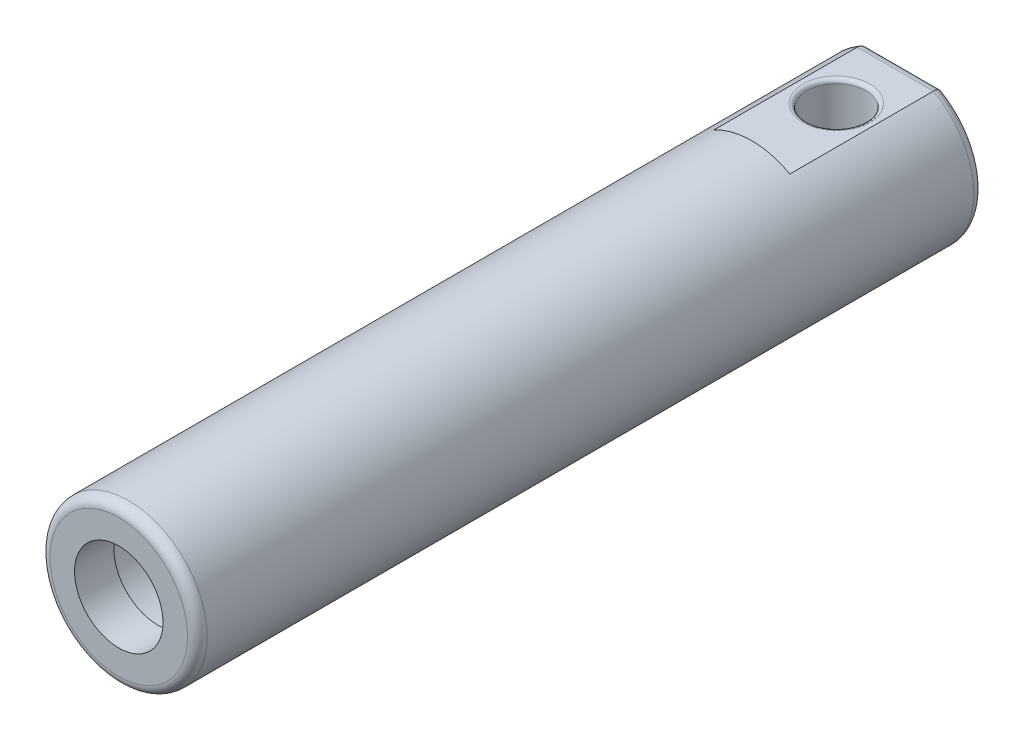
ISO-10303-21;
HEADER;
FILE_DESCRIPTION(('STEP AP214'),'2;1');
FILE_NAME('part.step','',(''),(''),'','','');
FILE_SCHEMA(('AUTOMOTIVE_DESIGN { 1 0 10303 214 1 1 1 1 }'));
ENDSEC;
DATA;
#1=APPLICATION_CONTEXT('core data for automotive mechanical design processes');
#2=APPLICATION_PROTOCOL_DEFINITION('international standard','automotive_design',2000,#1);
#3=PRODUCT_CONTEXT('',#1,'mechanical');
#4=PRODUCT('Part','Part','',(#3));
#5=PRODUCT_RELATED_PRODUCT_CATEGORY('part','',(#4));
#6=PRODUCT_DEFINITION_FORMATION('','',#4);
#7=PRODUCT_DEFINITION_CONTEXT('part definition',#1,'design');
#8=PRODUCT_DEFINITION('design','',#6,#7);
#9=PRODUCT_DEFINITION_SHAPE('','',#8);
#10=(LENGTH_UNIT() NAMED_UNIT(*) SI_UNIT(.MILLI.,.METRE.));
#11=(NAMED_UNIT(*) PLANE_ANGLE_UNIT() SI_UNIT($,.RADIAN.));
#12=(NAMED_UNIT(*) SI_UNIT($,.STERADIAN.) SOLID_ANGLE_UNIT());
#13=UNCERTAINTY_MEASURE_WITH_UNIT(LENGTH_MEASURE(1.E-05),#10,'distance_accuracy_value','');
#14=(GEOMETRIC_REPRESENTATION_CONTEXT(3) GLOBAL_UNCERTAINTY_ASSIGNED_CONTEXT((#13)) GLOBAL_UNIT_ASSIGNED_CONTEXT((#10,
#11,#12)) REPRESENTATION_CONTEXT('',''));
#15=CARTESIAN_POINT('',(0.,0.,0.));
#16=DIRECTION('',(0.,0.,1.));
#17=DIRECTION('',(1.,0.,0.));
#18=AXIS2_PLACEMENT_3D('',#15,#16,#17);
#19=CARTESIAN_POINT('',(0.,0.,320.));
#20=DIRECTION('',(0.,0.,-1.));
#21=DIRECTION('',(-1.,0.,0.));
#22=AXIS2_PLACEMENT_3D('',#19,#20,#21);
#23=CYLINDRICAL_SURFACE('',#22,40.);
#24=CARTESIAN_POINT('',(0.,0.,315.));
#25=DIRECTION('',(0.,0.,1.));
#26=DIRECTION('',(1.,0.,0.));
#27=AXIS2_PLACEMENT_3D('',#24,#25,#26);
#28=CIRCLE('',#27,40.);
#29=CARTESIAN_POINT('',(40.,0.,315.));
#30=VERTEX_POINT('',#29);
#31=EDGE_CURVE('E182',#30,#30,#28,.F.);
#32=ORIENTED_EDGE('',*,*,#31,.T.);
#33=EDGE_LOOP('',(#32));
#34=FACE_BOUND('',#33,.T.);
#35=DIRECTION('',(0.,0.,-1.));
#36=VECTOR('',#35,1.);
#37=CARTESIAN_POINT('',(19.3649167310371,-35.,320.));
#38=LINE('',#37,#36);
#39=CARTESIAN_POINT('',(19.3649167310371,-35.,-2.));
#40=VERTEX_POINT('',#39);
#41=CARTESIAN_POINT('',(19.3649167310371,-35.,-75.));
#42=VERTEX_POINT('',#41);
#43=EDGE_CURVE('E115',#40,#42,#38,.T.);
#44=ORIENTED_EDGE('',*,*,#43,.T.);
#45=CARTESIAN_POINT('',(0.,0.,-75.));
#46=DIRECTION('',(0.,0.,-1.));
#47=DIRECTION('',(-1.,0.,0.));
#48=AXIS2_PLACEMENT_3D('',#45,#46,#47);
#49=CIRCLE('',#48,40.);
#50=CARTESIAN_POINT('',(19.3649167310371,35.,-75.));
#51=VERTEX_POINT('',#50);
#52=EDGE_CURVE('E75',#42,#51,#49,.F.);
#53=ORIENTED_EDGE('',*,*,#52,.T.);
#54=DIRECTION('',(0.,0.,-1.));
#55=VECTOR('',#54,1.);
#56=CARTESIAN_POINT('',(19.3649167310371,35.,320.));
#57=LINE('',#56,#55);
#58=CARTESIAN_POINT('',(19.3649167310371,35.,-2.));
#59=VERTEX_POINT('',#58);
#60=EDGE_CURVE('E140',#51,#59,#57,.F.);
#61=ORIENTED_EDGE('',*,*,#60,.T.);
#62=CARTESIAN_POINT('',(0.,0.,-2.));
#63=DIRECTION('',(0.,0.,1.));
#64=DIRECTION('',(1.,0.,0.));
#65=AXIS2_PLACEMENT_3D('',#62,#63,#64);
#66=CIRCLE('',#65,40.);
#67=CARTESIAN_POINT('',(-19.3649167310371,35.,-2.));
#68=VERTEX_POINT('',#67);
#69=EDGE_CURVE('E123',#59,#68,#66,.T.);
#70=ORIENTED_EDGE('',*,*,#69,.T.);
#71=DIRECTION('',(0.,0.,-1.));
#72=VECTOR('',#71,1.);
#73=CARTESIAN_POINT('',(-19.3649167310371,35.,320.));
#74=LINE('',#73,#72);
#75=CARTESIAN_POINT('',(-19.3649167310371,35.,-75.));
#76=VERTEX_POINT('',#75);
#77=EDGE_CURVE('E143',#68,#76,#74,.T.);
#78=ORIENTED_EDGE('',*,*,#77,.T.);
#79=CARTESIAN_POINT('',(0.,0.,-75.));
#80=DIRECTION('',(0.,0.,-1.));
#81=DIRECTION('',(-1.,0.,0.));
#82=AXIS2_PLACEMENT_3D('',#79,#80,#81);
#83=CIRCLE('',#82,40.);
#84=CARTESIAN_POINT('',(-19.3649167310371,-35.,-75.));
#85=VERTEX_POINT('',#84);
#86=EDGE_CURVE('E109',#76,#85,#83,.F.);
#87=ORIENTED_EDGE('',*,*,#86,.T.);
#88=DIRECTION('',(0.,0.,-1.));
#89=VECTOR('',#88,1.);
#90=CARTESIAN_POINT('',(-19.3649167310371,-35.,320.));
#91=LINE('',#90,#89);
#92=CARTESIAN_POINT('',(-19.3649167310371,-35.,-2.));
#93=VERTEX_POINT('',#92);
#94=EDGE_CURVE('E104',#85,#93,#91,.F.);
#95=ORIENTED_EDGE('',*,*,#94,.T.);
#96=CARTESIAN_POINT('',(0.,0.,-2.));
#97=DIRECTION('',(0.,0.,-1.));
#98=DIRECTION('',(-1.,0.,0.));
#99=AXIS2_PLACEMENT_3D('',#96,#97,#98);
#100=CIRCLE('',#99,40.);
#101=EDGE_CURVE('E106',#40,#93,#100,.T.);
#102=ORIENTED_EDGE('',*,*,#101,.F.);
#103=EDGE_LOOP('',(#44,#53,#61,#70,#78,#87,#95,#102));
#104=FACE_BOUND('',#103,.T.);
#105=ADVANCED_FACE('F51',(#34,#104),#23,.T.);
#106=CARTESIAN_POINT('',(0.,0.,320.));
#107=DIRECTION('',(0.,0.,1.));
#108=DIRECTION('',(1.,0.,0.));
#109=AXIS2_PLACEMENT_3D('',#106,#107,#108);
#110=PLANE('',#109);
#111=CARTESIAN_POINT('',(0.,0.,320.));
#112=DIRECTION('',(0.,0.,1.));
#113=DIRECTION('',(1.,0.,0.));
#114=AXIS2_PLACEMENT_3D('',#111,#112,#113);
#115=CIRCLE('',#114,35.);
#116=CARTESIAN_POINT('',(35.,0.,320.));
#117=VERTEX_POINT('',#116);
#118=EDGE_CURVE('E190',#117,#117,#115,.T.);
#119=ORIENTED_EDGE('',*,*,#118,.T.);
#120=EDGE_LOOP('',(#119));
#121=FACE_BOUND('',#120,.T.);
#122=CARTESIAN_POINT('',(0.,0.,320.));
#123=DIRECTION('',(0.,0.,1.));
#124=DIRECTION('',(1.,0.,0.));
#125=AXIS2_PLACEMENT_3D('',#122,#123,#124);
#126=CIRCLE('',#125,22.5);
#127=CARTESIAN_POINT('',(22.5,0.,320.));
#128=VERTEX_POINT('',#127);
#129=EDGE_CURVE('E147',#128,#128,#126,.T.);
#130=ORIENTED_EDGE('',*,*,#129,.F.);
#131=EDGE_LOOP('',(#130));
#132=FACE_BOUND('',#131,.T.);
#133=ADVANCED_FACE('F267',(#121,#132),#110,.T.);
#134=CARTESIAN_POINT('',(0.,0.,300.));
#135=DIRECTION('',(0.,0.,-1.));
#136=DIRECTION('',(-1.,0.,0.));
#137=AXIS2_PLACEMENT_3D('',#134,#135,#136);
#138=CYLINDRICAL_SURFACE('',#137,30.);
#139=CARTESIAN_POINT('',(0.,0.,300.));
#140=DIRECTION('',(0.,0.,-1.));
#141=DIRECTION('',(-1.,0.,0.));
#142=AXIS2_PLACEMENT_3D('',#139,#140,#141);
#143=CIRCLE('',#142,30.);
#144=CARTESIAN_POINT('',(-30.,0.,300.));
#145=VERTEX_POINT('',#144);
#146=EDGE_CURVE('E151',#145,#145,#143,.T.);
#147=ORIENTED_EDGE('',*,*,#146,.F.);
#148=EDGE_LOOP('',(#147));
#149=FACE_BOUND('',#148,.T.);
#150=CARTESIAN_POINT('',(0.,0.,0.));
#151=DIRECTION('',(0.,0.,-1.));
#152=DIRECTION('',(-1.,0.,0.));
#153=AXIS2_PLACEMENT_3D('',#150,#151,#152);
#154=CIRCLE('',#153,30.);
#155=CARTESIAN_POINT('',(-30.,0.,0.));
#156=VERTEX_POINT('',#155);
#157=EDGE_CURVE('E146',#156,#156,#154,.T.);
#158=ORIENTED_EDGE('',*,*,#157,.T.);
#159=EDGE_LOOP('',(#158));
#160=FACE_BOUND('',#159,.T.);
#161=ADVANCED_FACE('F272',(#149,#160),#138,.F.);
#162=CARTESIAN_POINT('',(0.,0.,300.));
#163=DIRECTION('',(0.,0.,-1.));
#164=DIRECTION('',(-1.,0.,0.));
#165=AXIS2_PLACEMENT_3D('',#162,#163,#164);
#166=PLANE('',#165);
#167=CARTESIAN_POINT('',(0.,0.,300.));
#168=DIRECTION('',(0.,0.,-1.));
#169=DIRECTION('',(-1.,0.,0.));
#170=AXIS2_PLACEMENT_3D('',#167,#168,#169);
#171=CIRCLE('',#170,22.5);
#172=CARTESIAN_POINT('',(-22.5,0.,300.));
#173=VERTEX_POINT('',#172);
#174=EDGE_CURVE('E152',#173,#173,#171,.F.);
#175=ORIENTED_EDGE('',*,*,#174,.T.);
#176=EDGE_LOOP('',(#175));
#177=FACE_BOUND('',#176,.T.);
#178=ORIENTED_EDGE('',*,*,#146,.T.);
#179=EDGE_LOOP('',(#178));
#180=FACE_BOUND('',#179,.T.);
#181=ADVANCED_FACE('F278',(#177,#180),#166,.T.);
#182=CARTESIAN_POINT('',(0.,0.,-0.000999999999973245));
#183=DIRECTION('',(0.,0.,1.));
#184=DIRECTION('',(1.,0.,0.));
#185=AXIS2_PLACEMENT_3D('',#182,#183,#184);
#186=CYLINDRICAL_SURFACE('',#185,22.5);
#187=ORIENTED_EDGE('',*,*,#174,.F.);
#188=EDGE_LOOP('',(#187));
#189=FACE_BOUND('',#188,.T.);
#190=ORIENTED_EDGE('',*,*,#129,.T.);
#191=EDGE_LOOP('',(#190));
#192=FACE_BOUND('',#191,.T.);
#193=ADVANCED_FACE('F282',(#189,#192),#186,.F.);
#194=CARTESIAN_POINT('',(0.,0.,0.));
#195=DIRECTION('',(0.,0.,-1.));
#196=DIRECTION('',(-1.,0.,0.));
#197=AXIS2_PLACEMENT_3D('',#194,#195,#196);
#198=PLANE('',#197);
#199=ORIENTED_EDGE('',*,*,#157,.F.);
#200=EDGE_LOOP('',(#199));
#201=FACE_BOUND('',#200,.T.);
#202=ADVANCED_FACE('F286',(#201),#198,.F.);
#203=CARTESIAN_POINT('',(0.,0.,-80.));
#204=DIRECTION('',(0.,0.,-1.));
#205=DIRECTION('',(-1.,0.,0.));
#206=AXIS2_PLACEMENT_3D('',#203,#204,#205);
#207=PLANE('',#206);
#208=DIRECTION('',(-1.,0.,0.));
#209=VECTOR('',#208,1.);
#210=CARTESIAN_POINT('',(19.3649167310371,30.,-80.));
#211=LINE('',#210,#209);
#212=CARTESIAN_POINT('',(-18.0277563773199,30.,-80.));
#213=VERTEX_POINT('',#212);
#214=CARTESIAN_POINT('',(18.0277563773199,30.,-80.));
#215=VERTEX_POINT('',#214);
#216=EDGE_CURVE('E170',#213,#215,#211,.F.);
#217=ORIENTED_EDGE('',*,*,#216,.T.);
#218=CARTESIAN_POINT('',(0.,0.,-80.));
#219=DIRECTION('',(0.,0.,-1.));
#220=DIRECTION('',(-1.,0.,0.));
#221=AXIS2_PLACEMENT_3D('',#218,#219,#220);
#222=CIRCLE('',#221,35.);
#223=CARTESIAN_POINT('',(18.0277563773199,-30.,-80.));
#224=VERTEX_POINT('',#223);
#225=EDGE_CURVE('E177',#215,#224,#222,.T.);
#226=ORIENTED_EDGE('',*,*,#225,.T.);
#227=DIRECTION('',(1.,0.,0.));
#228=VECTOR('',#227,1.);
#229=CARTESIAN_POINT('',(-19.3649167310371,-30.,-80.));
#230=LINE('',#229,#228);
#231=CARTESIAN_POINT('',(-18.0277563773199,-30.,-80.));
#232=VERTEX_POINT('',#231);
#233=EDGE_CURVE('E173',#224,#232,#230,.F.);
#234=ORIENTED_EDGE('',*,*,#233,.T.);
#235=CARTESIAN_POINT('',(0.,0.,-80.));
#236=DIRECTION('',(0.,0.,-1.));
#237=DIRECTION('',(-1.,0.,0.));
#238=AXIS2_PLACEMENT_3D('',#235,#236,#237);
#239=CIRCLE('',#238,35.);
#240=EDGE_CURVE('E167',#232,#213,#239,.T.);
#241=ORIENTED_EDGE('',*,*,#240,.T.);
#242=EDGE_LOOP('',(#217,#226,#234,#241));
#243=FACE_BOUND('',#242,.T.);
#244=ADVANCED_FACE('F290',(#243),#207,.T.);
#245=CARTESIAN_POINT('',(20.,35.,-2.));
#246=DIRECTION('',(0.,0.,1.));
#247=DIRECTION('',(1.,0.,0.));
#248=AXIS2_PLACEMENT_3D('',#245,#246,#247);
#249=PLANE('',#248);
#250=DIRECTION('',(1.,0.,0.));
#251=VECTOR('',#250,1.);
#252=CARTESIAN_POINT('',(20.,35.,-2.));
#253=LINE('',#252,#251);
#254=EDGE_CURVE('E136',#68,#59,#253,.T.);
#255=ORIENTED_EDGE('',*,*,#254,.F.);
#256=ORIENTED_EDGE('',*,*,#69,.F.);
#257=EDGE_LOOP('',(#255,#256));
#258=FACE_BOUND('',#257,.T.);
#259=ADVANCED_FACE('F294',(#258),#249,.F.);
#260=CARTESIAN_POINT('',(0.,35.,0.));
#261=DIRECTION('',(0.,-1.,0.));
#262=DIRECTION('',(0.,0.,-1.));
#263=AXIS2_PLACEMENT_3D('',#260,#261,#262);
#264=PLANE('',#263);
#265=CARTESIAN_POINT('',(0.,35.,-45.));
#266=DIRECTION('',(0.,-1.,0.));
#267=DIRECTION('',(0.,0.,-1.));
#268=AXIS2_PLACEMENT_3D('',#265,#266,#267);
#269=CIRCLE('',#268,17.);
#270=CARTESIAN_POINT('',(0.,35.,-62.));
#271=VERTEX_POINT('',#270);
#272=EDGE_CURVE('E11',#271,#271,#269,.T.);
#273=ORIENTED_EDGE('',*,*,#272,.T.);
#274=EDGE_LOOP('',(#273));
#275=FACE_BOUND('',#274,.T.);
#276=ORIENTED_EDGE('',*,*,#60,.F.);
#277=DIRECTION('',(-1.,0.,0.));
#278=VECTOR('',#277,1.);
#279=CARTESIAN_POINT('',(-19.3649167310371,35.,-75.));
#280=LINE('',#279,#278);
#281=EDGE_CURVE('E67',#51,#76,#280,.T.);
#282=ORIENTED_EDGE('',*,*,#281,.T.);
#283=ORIENTED_EDGE('',*,*,#77,.F.);
#284=ORIENTED_EDGE('',*,*,#254,.T.);
#285=EDGE_LOOP('',(#276,#282,#283,#284));
#286=FACE_BOUND('',#285,.T.);
#287=ADVANCED_FACE('F264',(#275,#286),#264,.F.);
#288=CARTESIAN_POINT('',(20.,-35.,-2.));
#289=DIRECTION('',(0.,0.,-1.));
#290=DIRECTION('',(-1.,0.,0.));
#291=AXIS2_PLACEMENT_3D('',#288,#289,#290);
#292=PLANE('',#291);
#293=DIRECTION('',(1.,0.,0.));
#294=VECTOR('',#293,1.);
#295=CARTESIAN_POINT('',(20.,-35.,-2.));
#296=LINE('',#295,#294);
#297=EDGE_CURVE('E116',#93,#40,#296,.T.);
#298=ORIENTED_EDGE('',*,*,#297,.T.);
#299=ORIENTED_EDGE('',*,*,#101,.T.);
#300=EDGE_LOOP('',(#298,#299));
#301=FACE_BOUND('',#300,.T.);
#302=ADVANCED_FACE('F120',(#301),#292,.T.);
#303=CARTESIAN_POINT('',(0.,-35.,0.));
#304=DIRECTION('',(0.,1.,0.));
#305=DIRECTION('',(0.,0.,-1.));
#306=AXIS2_PLACEMENT_3D('',#303,#304,#305);
#307=PLANE('',#306);
#308=CARTESIAN_POINT('',(0.,-35.,-45.));
#309=DIRECTION('',(0.,1.,0.));
#310=DIRECTION('',(0.,0.,1.));
#311=AXIS2_PLACEMENT_3D('',#308,#309,#310);
#312=CIRCLE('',#311,17.);
#313=CARTESIAN_POINT('',(0.,-35.,-28.));
#314=VERTEX_POINT('',#313);
#315=EDGE_CURVE('E194',#314,#314,#312,.T.);
#316=ORIENTED_EDGE('',*,*,#315,.T.);
#317=EDGE_LOOP('',(#316));
#318=FACE_BOUND('',#317,.T.);
#319=ORIENTED_EDGE('',*,*,#94,.F.);
#320=DIRECTION('',(1.,0.,0.));
#321=VECTOR('',#320,1.);
#322=CARTESIAN_POINT('',(19.3649167310371,-35.,-75.));
#323=LINE('',#322,#321);
#324=EDGE_CURVE('E122',#85,#42,#323,.T.);
#325=ORIENTED_EDGE('',*,*,#324,.T.);
#326=ORIENTED_EDGE('',*,*,#43,.F.);
#327=ORIENTED_EDGE('',*,*,#297,.F.);
#328=EDGE_LOOP('',(#319,#325,#326,#327));
#329=FACE_BOUND('',#328,.T.);
#330=ADVANCED_FACE('F125',(#318,#329),#307,.F.);
#331=CARTESIAN_POINT('',(0.,-40.,-45.));
#332=DIRECTION('',(0.,1.,0.));
#333=DIRECTION('',(0.,0.,1.));
#334=AXIS2_PLACEMENT_3D('',#331,#332,#333);
#335=CYLINDRICAL_SURFACE('',#334,15.);
#336=CARTESIAN_POINT('',(0.,-33.,-45.));
#337=DIRECTION('',(0.,1.,0.));
#338=DIRECTION('',(0.,0.,1.));
#339=AXIS2_PLACEMENT_3D('',#336,#337,#338);
#340=CIRCLE('',#339,15.);
#341=CARTESIAN_POINT('',(0.,-33.,-30.));
#342=VERTEX_POINT('',#341);
#343=EDGE_CURVE('E60',#342,#342,#340,.F.);
#344=ORIENTED_EDGE('',*,*,#343,.T.);
#345=EDGE_LOOP('',(#344));
#346=FACE_BOUND('',#345,.T.);
#347=CARTESIAN_POINT('',(0.,33.,-45.));
#348=DIRECTION('',(0.,-1.,0.));
#349=DIRECTION('',(0.,0.,-1.));
#350=AXIS2_PLACEMENT_3D('',#347,#348,#349);
#351=CIRCLE('',#350,15.);
#352=CARTESIAN_POINT('',(0.,33.,-60.));
#353=VERTEX_POINT('',#352);
#354=EDGE_CURVE('E241',#353,#353,#351,.F.);
#355=ORIENTED_EDGE('',*,*,#354,.T.);
#356=EDGE_LOOP('',(#355));
#357=FACE_BOUND('',#356,.T.);
#358=ADVANCED_FACE('F248',(#346,#357),#335,.F.);
#359=CARTESIAN_POINT('',(0.,30.,-75.));
#360=DIRECTION('',(1.,0.,0.));
#361=DIRECTION('',(0.,0.,-1.));
#362=AXIS2_PLACEMENT_3D('',#359,#360,#361);
#363=CYLINDRICAL_SURFACE('',#362,5.);
#364=CARTESIAN_POINT('',(19.3649167310371,35.,-75.));
#365=CARTESIAN_POINT('',(19.3649205000472,35.0000173063587,-75.1373300823666));
#366=CARTESIAN_POINT('',(19.3634560485535,34.9943428859047,-75.274656459659));
#367=CARTESIAN_POINT('',(19.3576181535194,34.9717364820633,-75.5483028599108));
#368=CARTESIAN_POINT('',(19.3532450243962,34.9548057154452,-75.6846229900317));
#369=CARTESIAN_POINT('',(19.3416261638452,34.9098470979698,-75.9550796892259));
#370=CARTESIAN_POINT('',(19.3343848657596,34.8818363735429,-76.0892192971751));
#371=CARTESIAN_POINT('',(19.3170824375608,34.8149598614034,-76.3545774983745));
#372=CARTESIAN_POINT('',(19.3070213095176,34.776094081659,-76.4857960937688));
#373=CARTESIAN_POINT('',(19.2841501344437,34.687831589201,-76.744391346056));
#374=CARTESIAN_POINT('',(19.2713401412811,34.6384350828529,-76.8717680781803));
#375=CARTESIAN_POINT('',(19.2430551174511,34.5294970244326,-77.1218544476447));
#376=CARTESIAN_POINT('',(19.2275791042661,34.4699517322799,-77.244562343936));
#377=CARTESIAN_POINT('',(19.1940775483916,34.3412332572752,-77.4843930463797));
#378=CARTESIAN_POINT('',(19.1760529723853,34.2720637251054,-77.6015179477709));
#379=CARTESIAN_POINT('',(19.1375638119286,34.124597829654,-77.8295109361486));
#380=CARTESIAN_POINT('',(19.117098317491,34.046298062818,-77.940376666847));
#381=CARTESIAN_POINT('',(19.073592618746,33.8801456430501,-78.1564662131131));
#382=CARTESIAN_POINT('',(19.0505230515161,33.7921844263201,-78.2616006388835));
#383=CARTESIAN_POINT('',(19.0021690194121,33.6081842659145,-78.464062393414));
#384=CARTESIAN_POINT('',(18.9768837413686,33.5121423571317,-78.5613868305797));
#385=CARTESIAN_POINT('',(18.9242680250719,33.3127229039829,-78.7475949158082));
#386=CARTESIAN_POINT('',(18.8969377463804,33.2093459319695,-78.836479221189));
#387=CARTESIAN_POINT('',(18.8404030529096,32.9959985980431,-79.0053126202324));
#388=CARTESIAN_POINT('',(18.8111979601336,32.8860258518288,-79.0852584524564));
#389=CARTESIAN_POINT('',(18.7192365267765,32.5405997889948,-79.3154703404751));
#390=CARTESIAN_POINT('',(18.653690029167,32.2955480443525,-79.4505909558365));
#391=CARTESIAN_POINT('',(18.5170986094543,31.7878283565171,-79.677718698753));
#392=CARTESIAN_POINT('',(18.4460547666586,31.5251638726214,-79.7697342643313));
#393=CARTESIAN_POINT('',(18.318034336937,31.0547331089447,-79.8919752896394));
#394=CARTESIAN_POINT('',(18.2618464490138,30.8491792251893,-79.9317922569326));
#395=CARTESIAN_POINT('',(18.1481818781669,30.4353289121423,-79.9853665718674));
#396=CARTESIAN_POINT('',(18.0907078245094,30.2270383834892,-79.9991729045456));
#397=CARTESIAN_POINT('',(18.0312670286032,30.0126587518701,-79.999988010274));
#398=CARTESIAN_POINT('',(18.0295117941304,30.0063292392045,-80.000000029633));
#399=CARTESIAN_POINT('',(18.0277563773199,30.,-80.));
#400=B_SPLINE_CURVE_WITH_KNOTS('',3,(#364,#365,#366,#367,#368,#369,#370,#371,#372,#373,#374,
#375,#376,#377,#378,#379,#380,#381,#382,#383,#384,#385,#386,#387,#388,#389,#390,#391,#392,#393,
#394,#395,#396,#397,#398,#399),.UNSPECIFIED.,.F.,.F.,(4,2,2,2,2,2,2,2,2,2,2,2,2,2,2,2,2,4),(0.,
0.411859747012903,0.823674980748621,1.2348561384173,1.64603699425728,2.05720979312629,
2.46853444835601,2.87970350246257,3.29102632450073,3.70756593899954,4.12425906962515,
4.54091972149968,4.95773191028552,5.81576637716023,6.67363280935224,7.322536645826,
7.97021719507692,7.98992230705255),.UNSPECIFIED.);
#401=EDGE_CURVE('E131',#215,#51,#400,.F.);
#402=ORIENTED_EDGE('',*,*,#401,.F.);
#403=ORIENTED_EDGE('',*,*,#216,.F.);
#404=CARTESIAN_POINT('',(-19.3649167310371,35.,-75.));
#405=CARTESIAN_POINT('',(-19.3649205000472,35.0000173063587,-75.1373300823666));
#406=CARTESIAN_POINT('',(-19.3634560485535,34.9943428859047,-75.274656459659));
#407=CARTESIAN_POINT('',(-19.3576181535194,34.9717364820633,-75.5483028599108));
#408=CARTESIAN_POINT('',(-19.3532450243962,34.9548057154452,-75.6846229900317));
#409=CARTESIAN_POINT('',(-19.3416261638452,34.9098470979698,-75.9550796892259));
#410=CARTESIAN_POINT('',(-19.3343848657596,34.8818363735429,-76.0892192971751));
#411=CARTESIAN_POINT('',(-19.3170824375608,34.8149598614034,-76.3545774983745));
#412=CARTESIAN_POINT('',(-19.3070213095176,34.776094081659,-76.4857960937688));
#413=CARTESIAN_POINT('',(-19.2841501344437,34.687831589201,-76.744391346056));
#414=CARTESIAN_POINT('',(-19.2713401412811,34.6384350828529,-76.8717680781803));
#415=CARTESIAN_POINT('',(-19.2430551174511,34.5294970244326,-77.1218544476447));
#416=CARTESIAN_POINT('',(-19.2275791042661,34.4699517322799,-77.244562343936));
#417=CARTESIAN_POINT('',(-19.1940775483916,34.3412332572752,-77.4843930463797));
#418=CARTESIAN_POINT('',(-19.1760529723853,34.2720637251054,-77.6015179477709));
#419=CARTESIAN_POINT('',(-19.1375638119286,34.124597829654,-77.8295109361486));
#420=CARTESIAN_POINT('',(-19.117098317491,34.046298062818,-77.940376666847));
#421=CARTESIAN_POINT('',(-19.073592618746,33.8801456430501,-78.1564662131131));
#422=CARTESIAN_POINT('',(-19.0505230515161,33.7921844263201,-78.2616006388835));
#423=CARTESIAN_POINT('',(-19.0021690194121,33.6081842659145,-78.464062393414));
#424=CARTESIAN_POINT('',(-18.9768837413686,33.5121423571317,-78.5613868305797));
#425=CARTESIAN_POINT('',(-18.9242680250719,33.3127229039829,-78.7475949158082));
#426=CARTESIAN_POINT('',(-18.8969377463804,33.2093459319695,-78.836479221189));
#427=CARTESIAN_POINT('',(-18.8404030529096,32.9959985980431,-79.0053126202324));
#428=CARTESIAN_POINT('',(-18.8111979601336,32.8860258518288,-79.0852584524564));
#429=CARTESIAN_POINT('',(-18.7192365267765,32.5405997889948,-79.3154703404751));
#430=CARTESIAN_POINT('',(-18.653690029167,32.2955480443525,-79.4505909558365));
#431=CARTESIAN_POINT('',(-18.5170986094543,31.7878283565171,-79.677718698753));
#432=CARTESIAN_POINT('',(-18.4460547666586,31.5251638726214,-79.7697342643313));
#433=CARTESIAN_POINT('',(-18.318034336937,31.0547331089447,-79.8919752896394));
#434=CARTESIAN_POINT('',(-18.2618464490138,30.8491792251893,-79.9317922569326));
#435=CARTESIAN_POINT('',(-18.1481818781669,30.4353289121423,-79.9853665718674));
#436=CARTESIAN_POINT('',(-18.0907078245094,30.2270383834892,-79.9991729045456));
#437=CARTESIAN_POINT('',(-18.0312670286032,30.0126587518701,-79.999988010274));
#438=CARTESIAN_POINT('',(-18.0295117941304,30.0063292392045,-80.000000029633));
#439=CARTESIAN_POINT('',(-18.0277563773199,30.,-80.));
#440=B_SPLINE_CURVE_WITH_KNOTS('',3,(#404,#405,#406,#407,#408,#409,#410,#411,#412,#413,#414,
#415,#416,#417,#418,#419,#420,#421,#422,#423,#424,#425,#426,#427,#428,#429,#430,#431,#432,#433,
#434,#435,#436,#437,#438,#439),.UNSPECIFIED.,.F.,.F.,(4,2,2,2,2,2,2,2,2,2,2,2,2,2,2,2,2,4),(0.,
0.411859747012903,0.823674980748621,1.2348561384173,1.64603699425728,2.05720979312629,
2.46853444835601,2.87970350246257,3.29102632450073,3.70756593899954,4.12425906962515,
4.54091972149968,4.95773191028552,5.81576637716023,6.67363280935224,7.322536645826,
7.97021719507692,7.98992230705255),.UNSPECIFIED.);
#441=EDGE_CURVE('E127',#76,#213,#440,.T.);
#442=ORIENTED_EDGE('',*,*,#441,.F.);
#443=ORIENTED_EDGE('',*,*,#281,.F.);
#444=EDGE_LOOP('',(#402,#403,#442,#443));
#445=FACE_BOUND('',#444,.T.);
#446=ADVANCED_FACE('F224',(#445),#363,.T.);
#447=CARTESIAN_POINT('',(0.,0.,-75.));
#448=DIRECTION('',(0.,0.,-1.));
#449=DIRECTION('',(-1.,0.,0.));
#450=AXIS2_PLACEMENT_3D('',#447,#448,#449);
#451=TOROIDAL_SURFACE('',#450,35.,5.);
#452=ORIENTED_EDGE('',*,*,#441,.T.);
#453=ORIENTED_EDGE('',*,*,#240,.F.);
#454=CARTESIAN_POINT('',(-19.3649167310371,-35.,-75.));
#455=CARTESIAN_POINT('',(-19.3649205000472,-35.0000173063587,-75.1373300823666));
#456=CARTESIAN_POINT('',(-19.3634560485535,-34.9943428859047,-75.274656459659));
#457=CARTESIAN_POINT('',(-19.3576181535194,-34.9717364820633,-75.5483028599108));
#458=CARTESIAN_POINT('',(-19.3532450243962,-34.9548057154452,-75.6846229900317));
#459=CARTESIAN_POINT('',(-19.3416261638452,-34.9098470979698,-75.9550796892259));
#460=CARTESIAN_POINT('',(-19.3343848657596,-34.8818363735429,-76.0892192971751));
#461=CARTESIAN_POINT('',(-19.3170824375608,-34.8149598614034,-76.3545774983745));
#462=CARTESIAN_POINT('',(-19.3070213095176,-34.776094081659,-76.4857960937688));
#463=CARTESIAN_POINT('',(-19.2841501344437,-34.687831589201,-76.744391346056));
#464=CARTESIAN_POINT('',(-19.2713401412811,-34.6384350828529,-76.8717680781803));
#465=CARTESIAN_POINT('',(-19.2430551174511,-34.5294970244326,-77.1218544476447));
#466=CARTESIAN_POINT('',(-19.2275791042661,-34.4699517322799,-77.244562343936));
#467=CARTESIAN_POINT('',(-19.1940775483916,-34.3412332572752,-77.4843930463797));
#468=CARTESIAN_POINT('',(-19.1760529723853,-34.2720637251054,-77.6015179477709));
#469=CARTESIAN_POINT('',(-19.1375638119286,-34.124597829654,-77.8295109361486));
#470=CARTESIAN_POINT('',(-19.117098317491,-34.046298062818,-77.940376666847));
#471=CARTESIAN_POINT('',(-19.073592618746,-33.8801456430501,-78.1564662131131));
#472=CARTESIAN_POINT('',(-19.0505230515161,-33.7921844263201,-78.2616006388835));
#473=CARTESIAN_POINT('',(-19.0021690194121,-33.6081842659145,-78.464062393414));
#474=CARTESIAN_POINT('',(-18.9768837413686,-33.5121423571317,-78.5613868305797));
#475=CARTESIAN_POINT('',(-18.9242680250719,-33.3127229039829,-78.7475949158082));
#476=CARTESIAN_POINT('',(-18.8969377463804,-33.2093459319695,-78.836479221189));
#477=CARTESIAN_POINT('',(-18.8404030529096,-32.9959985980431,-79.0053126202324));
#478=CARTESIAN_POINT('',(-18.8111979601336,-32.8860258518288,-79.0852584524564));
#479=CARTESIAN_POINT('',(-18.7192365267765,-32.5405997889948,-79.3154703404751));
#480=CARTESIAN_POINT('',(-18.653690029167,-32.2955480443525,-79.4505909558365));
#481=CARTESIAN_POINT('',(-18.5170986094543,-31.7878283565171,-79.677718698753));
#482=CARTESIAN_POINT('',(-18.4460547666586,-31.5251638726214,-79.7697342643313));
#483=CARTESIAN_POINT('',(-18.318034336937,-31.0547331089447,-79.8919752896394));
#484=CARTESIAN_POINT('',(-18.2618464490138,-30.8491792251893,-79.9317922569326));
#485=CARTESIAN_POINT('',(-18.1481818781669,-30.4353289121423,-79.9853665718674));
#486=CARTESIAN_POINT('',(-18.0907078245094,-30.2270383834892,-79.9991729045456));
#487=CARTESIAN_POINT('',(-18.0312670286032,-30.0126587518701,-79.999988010274));
#488=CARTESIAN_POINT('',(-18.0295117941304,-30.0063292392045,-80.000000029633));
#489=CARTESIAN_POINT('',(-18.0277563773199,-30.,-80.));
#490=B_SPLINE_CURVE_WITH_KNOTS('',3,(#454,#455,#456,#457,#458,#459,#460,#461,#462,#463,#464,
#465,#466,#467,#468,#469,#470,#471,#472,#473,#474,#475,#476,#477,#478,#479,#480,#481,#482,#483,
#484,#485,#486,#487,#488,#489),.UNSPECIFIED.,.F.,.F.,(4,2,2,2,2,2,2,2,2,2,2,2,2,2,2,2,2,4),(0.,
0.411859747012903,0.823674980748621,1.2348561384173,1.64603699425728,2.05720979312629,
2.46853444835601,2.87970350246257,3.29102632450073,3.70756593899954,4.12425906962515,
4.54091972149968,4.95773191028552,5.81576637716023,6.67363280935224,7.322536645826,
7.97021719507692,7.98992230705255),.UNSPECIFIED.);
#491=EDGE_CURVE('E204',#85,#232,#490,.T.);
#492=ORIENTED_EDGE('',*,*,#491,.F.);
#493=ORIENTED_EDGE('',*,*,#86,.F.);
#494=EDGE_LOOP('',(#452,#453,#492,#493));
#495=FACE_BOUND('',#494,.T.);
#496=ADVANCED_FACE('F219',(#495),#451,.T.);
#497=CARTESIAN_POINT('',(0.,0.,-75.));
#498=DIRECTION('',(0.,0.,-1.));
#499=DIRECTION('',(-1.,0.,0.));
#500=AXIS2_PLACEMENT_3D('',#497,#498,#499);
#501=TOROIDAL_SURFACE('',#500,35.,5.);
#502=ORIENTED_EDGE('',*,*,#401,.T.);
#503=ORIENTED_EDGE('',*,*,#52,.F.);
#504=CARTESIAN_POINT('',(19.3649167310371,-35.,-75.));
#505=CARTESIAN_POINT('',(19.3649205000472,-35.0000173063587,-75.1373300823666));
#506=CARTESIAN_POINT('',(19.3634560485535,-34.9943428859047,-75.274656459659));
#507=CARTESIAN_POINT('',(19.3576181535194,-34.9717364820633,-75.5483028599108));
#508=CARTESIAN_POINT('',(19.3532450243962,-34.9548057154452,-75.6846229900317));
#509=CARTESIAN_POINT('',(19.3416261638452,-34.9098470979698,-75.9550796892259));
#510=CARTESIAN_POINT('',(19.3343848657596,-34.8818363735429,-76.0892192971751));
#511=CARTESIAN_POINT('',(19.3170824375608,-34.8149598614034,-76.3545774983745));
#512=CARTESIAN_POINT('',(19.3070213095176,-34.776094081659,-76.4857960937688));
#513=CARTESIAN_POINT('',(19.2841501344437,-34.687831589201,-76.744391346056));
#514=CARTESIAN_POINT('',(19.2713401412811,-34.6384350828529,-76.8717680781803));
#515=CARTESIAN_POINT('',(19.2430551174511,-34.5294970244326,-77.1218544476447));
#516=CARTESIAN_POINT('',(19.2275791042661,-34.4699517322799,-77.244562343936));
#517=CARTESIAN_POINT('',(19.1940775483916,-34.3412332572752,-77.4843930463797));
#518=CARTESIAN_POINT('',(19.1760529723853,-34.2720637251054,-77.6015179477709));
#519=CARTESIAN_POINT('',(19.1375638119286,-34.124597829654,-77.8295109361486));
#520=CARTESIAN_POINT('',(19.117098317491,-34.046298062818,-77.940376666847));
#521=CARTESIAN_POINT('',(19.073592618746,-33.8801456430501,-78.1564662131131));
#522=CARTESIAN_POINT('',(19.0505230515161,-33.7921844263201,-78.2616006388835));
#523=CARTESIAN_POINT('',(19.0021690194121,-33.6081842659145,-78.464062393414));
#524=CARTESIAN_POINT('',(18.9768837413686,-33.5121423571317,-78.5613868305797));
#525=CARTESIAN_POINT('',(18.9242680250719,-33.3127229039829,-78.7475949158082));
#526=CARTESIAN_POINT('',(18.8969377463804,-33.2093459319695,-78.836479221189));
#527=CARTESIAN_POINT('',(18.8404030529096,-32.9959985980431,-79.0053126202324));
#528=CARTESIAN_POINT('',(18.8111979601336,-32.8860258518288,-79.0852584524564));
#529=CARTESIAN_POINT('',(18.7192365267765,-32.5405997889948,-79.3154703404751));
#530=CARTESIAN_POINT('',(18.653690029167,-32.2955480443525,-79.4505909558365));
#531=CARTESIAN_POINT('',(18.5170986094543,-31.7878283565171,-79.677718698753));
#532=CARTESIAN_POINT('',(18.4460547666586,-31.5251638726214,-79.7697342643313));
#533=CARTESIAN_POINT('',(18.318034336937,-31.0547331089447,-79.8919752896394));
#534=CARTESIAN_POINT('',(18.2618464490138,-30.8491792251893,-79.9317922569326));
#535=CARTESIAN_POINT('',(18.1481818781669,-30.4353289121423,-79.9853665718674));
#536=CARTESIAN_POINT('',(18.0907078245094,-30.2270383834892,-79.9991729045456));
#537=CARTESIAN_POINT('',(18.0312670286032,-30.0126587518701,-79.999988010274));
#538=CARTESIAN_POINT('',(18.0295117941304,-30.0063292392045,-80.000000029633));
#539=CARTESIAN_POINT('',(18.0277563773199,-30.,-80.));
#540=B_SPLINE_CURVE_WITH_KNOTS('',3,(#504,#505,#506,#507,#508,#509,#510,#511,#512,#513,#514,
#515,#516,#517,#518,#519,#520,#521,#522,#523,#524,#525,#526,#527,#528,#529,#530,#531,#532,#533,
#534,#535,#536,#537,#538,#539),.UNSPECIFIED.,.F.,.F.,(4,2,2,2,2,2,2,2,2,2,2,2,2,2,2,2,2,4),(0.,
0.411859747012903,0.823674980748621,1.2348561384173,1.64603699425728,2.05720979312629,
2.46853444835601,2.87970350246257,3.29102632450073,3.70756593899954,4.12425906962515,
4.54091972149968,4.95773191028552,5.81576637716023,6.67363280935224,7.322536645826,
7.97021719507692,7.98992230705255),.UNSPECIFIED.);
#541=EDGE_CURVE('E195',#224,#42,#540,.F.);
#542=ORIENTED_EDGE('',*,*,#541,.F.);
#543=ORIENTED_EDGE('',*,*,#225,.F.);
#544=EDGE_LOOP('',(#502,#503,#542,#543));
#545=FACE_BOUND('',#544,.T.);
#546=ADVANCED_FACE('F211',(#545),#501,.T.);
#547=CARTESIAN_POINT('',(0.,-30.,-75.));
#548=DIRECTION('',(-1.,0.,0.));
#549=DIRECTION('',(0.,0.,1.));
#550=AXIS2_PLACEMENT_3D('',#547,#548,#549);
#551=CYLINDRICAL_SURFACE('',#550,5.);
#552=ORIENTED_EDGE('',*,*,#491,.T.);
#553=ORIENTED_EDGE('',*,*,#233,.F.);
#554=ORIENTED_EDGE('',*,*,#541,.T.);
#555=ORIENTED_EDGE('',*,*,#324,.F.);
#556=EDGE_LOOP('',(#552,#553,#554,#555));
#557=FACE_BOUND('',#556,.T.);
#558=ADVANCED_FACE('F214',(#557),#551,.T.);
#559=CARTESIAN_POINT('',(0.,0.,315.));
#560=DIRECTION('',(0.,0.,1.));
#561=DIRECTION('',(1.,0.,0.));
#562=AXIS2_PLACEMENT_3D('',#559,#560,#561);
#563=TOROIDAL_SURFACE('',#562,35.,5.);
#564=ORIENTED_EDGE('',*,*,#31,.F.);
#565=EDGE_LOOP('',(#564));
#566=FACE_BOUND('',#565,.T.);
#567=ORIENTED_EDGE('',*,*,#118,.F.);
#568=EDGE_LOOP('',(#567));
#569=FACE_BOUND('',#568,.T.);
#570=ADVANCED_FACE('F217',(#566,#569),#563,.T.);
#571=CARTESIAN_POINT('',(0.,-33.,-45.));
#572=DIRECTION('',(0.,1.,0.));
#573=DIRECTION('',(0.,0.,1.));
#574=AXIS2_PLACEMENT_3D('',#571,#572,#573);
#575=TOROIDAL_SURFACE('',#574,17.,2.);
#576=ORIENTED_EDGE('',*,*,#343,.F.);
#577=EDGE_LOOP('',(#576));
#578=FACE_BOUND('',#577,.T.);
#579=ORIENTED_EDGE('',*,*,#315,.F.);
#580=EDGE_LOOP('',(#579));
#581=FACE_BOUND('',#580,.T.);
#582=ADVANCED_FACE('F251',(#578,#581),#575,.T.);
#583=CARTESIAN_POINT('',(0.,33.,-45.));
#584=DIRECTION('',(0.,-1.,0.));
#585=DIRECTION('',(0.,0.,-1.));
#586=AXIS2_PLACEMENT_3D('',#583,#584,#585);
#587=TOROIDAL_SURFACE('',#586,17.,2.);
#588=ORIENTED_EDGE('',*,*,#272,.F.);
#589=EDGE_LOOP('',(#588));
#590=FACE_BOUND('',#589,.T.);
#591=ORIENTED_EDGE('',*,*,#354,.F.);
#592=EDGE_LOOP('',(#591));
#593=FACE_BOUND('',#592,.T.);
#594=ADVANCED_FACE('F53',(#590,#593),#587,.T.);
#595=CLOSED_SHELL('',(#105,#133,#161,#181,#193,#202,#244,#259,#287,#302,#330,#358,#446,#496,
#546,#558,#570,#582,#594));
#596=MANIFOLD_SOLID_BREP('B2',#595);
#597=ADVANCED_BREP_SHAPE_REPRESENTATION('',(#18,#596),#14);
#598=SHAPE_DEFINITION_REPRESENTATION(#9,#597);
ENDSEC;
END-ISO-10303-21;
